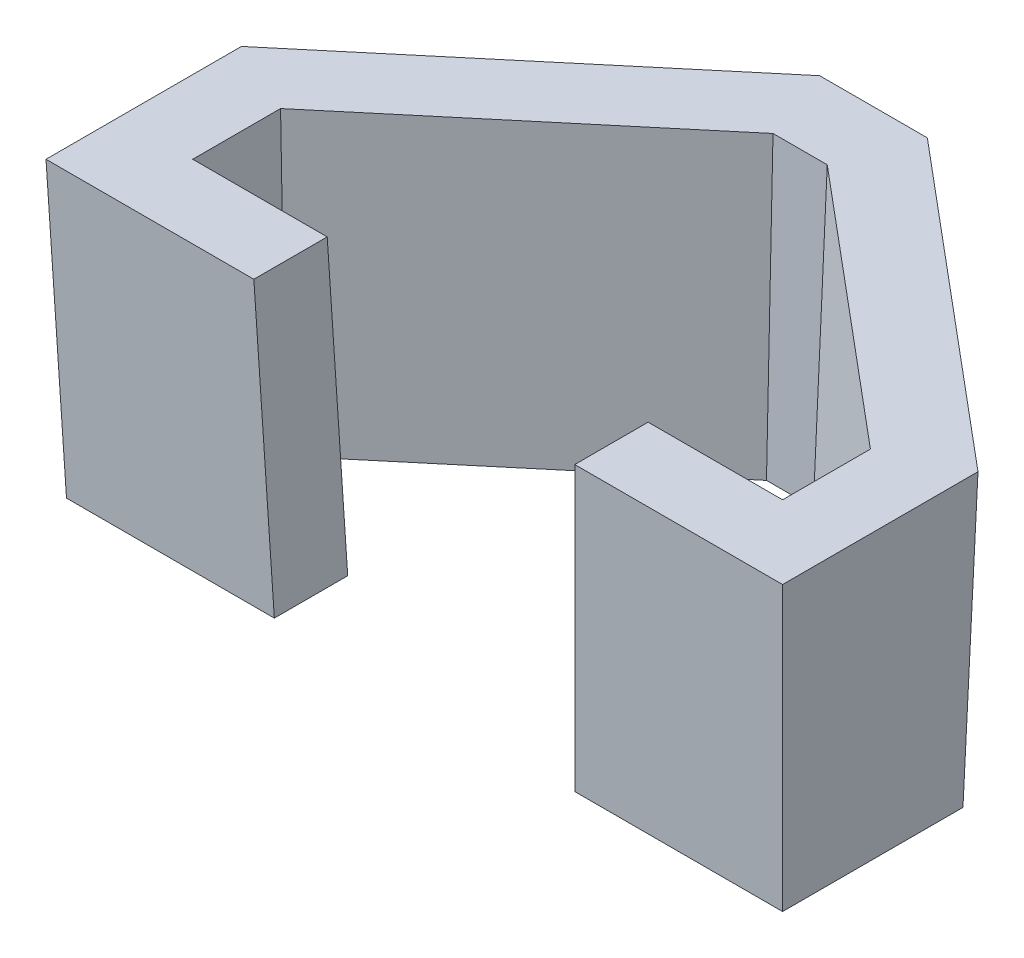
ISO-10303-21;
HEADER;
FILE_DESCRIPTION(('STEP AP214'),'2;1');
FILE_NAME('part.step','',(''),(''),'','','');
FILE_SCHEMA(('AUTOMOTIVE_DESIGN { 1 0 10303 214 1 1 1 1 }'));
ENDSEC;
DATA;
#1=APPLICATION_CONTEXT('core data for automotive mechanical design processes');
#2=APPLICATION_PROTOCOL_DEFINITION('international standard','automotive_design',2000,#1);
#3=PRODUCT_CONTEXT('',#1,'mechanical');
#4=PRODUCT('Part','Part','',(#3));
#5=PRODUCT_RELATED_PRODUCT_CATEGORY('part','',(#4));
#6=PRODUCT_DEFINITION_FORMATION('','',#4);
#7=PRODUCT_DEFINITION_CONTEXT('part definition',#1,'design');
#8=PRODUCT_DEFINITION('design','',#6,#7);
#9=PRODUCT_DEFINITION_SHAPE('','',#8);
#10=(LENGTH_UNIT() NAMED_UNIT(*) SI_UNIT(.MILLI.,.METRE.));
#11=(NAMED_UNIT(*) PLANE_ANGLE_UNIT() SI_UNIT($,.RADIAN.));
#12=(NAMED_UNIT(*) SI_UNIT($,.STERADIAN.) SOLID_ANGLE_UNIT());
#13=UNCERTAINTY_MEASURE_WITH_UNIT(LENGTH_MEASURE(1.E-05),#10,'distance_accuracy_value','');
#14=(GEOMETRIC_REPRESENTATION_CONTEXT(3) GLOBAL_UNCERTAINTY_ASSIGNED_CONTEXT((#13)) GLOBAL_UNIT_ASSIGNED_CONTEXT((#10,
#11,#12)) REPRESENTATION_CONTEXT('',''));
#15=CARTESIAN_POINT('',(0.,0.,0.));
#16=DIRECTION('',(0.,0.,1.));
#17=DIRECTION('',(1.,0.,0.));
#18=AXIS2_PLACEMENT_3D('',#15,#16,#17);
#19=CARTESIAN_POINT('',(111.25,0.,12.7));
#20=DIRECTION('',(0.,-0.034899496702501,0.999390827019096));
#21=DIRECTION('',(0.,-0.999390827019096,-0.034899496702501));
#22=AXIS2_PLACEMENT_3D('',#19,#20,#21);
#23=PLANE('',#22);
#24=DIRECTION('',(1.,0.,0.));
#25=VECTOR('',#24,1.);
#26=CARTESIAN_POINT('',(111.25,50.8,14.4739750901808));
#27=LINE('',#26,#25);
#28=CARTESIAN_POINT('',(77.0489750901808,50.8,14.4739750901808));
#29=VERTEX_POINT('',#28);
#30=CARTESIAN_POINT('',(113.023975090181,50.8,14.4739750901808));
#31=VERTEX_POINT('',#30);
#32=EDGE_CURVE('E327',#29,#31,#27,.T.);
#33=ORIENTED_EDGE('',*,*,#32,.F.);
#34=DIRECTION('',(-0.0348782627423747,-0.998782765958718,-0.0348782627423747));
#35=VECTOR('',#34,1.);
#36=CARTESIAN_POINT('',(75.2595505362086,-0.442414758217532,12.6845505362085));
#37=LINE('',#36,#35);
#38=CARTESIAN_POINT('',(75.275,0.,12.7));
#39=VERTEX_POINT('',#38);
#40=EDGE_CURVE('E317',#29,#39,#37,.T.);
#41=ORIENTED_EDGE('',*,*,#40,.T.);
#42=DIRECTION('',(-1.,0.,0.));
#43=VECTOR('',#42,1.);
#44=CARTESIAN_POINT('',(111.25,0.,12.7));
#45=LINE('',#44,#43);
#46=CARTESIAN_POINT('',(111.25,0.,12.7));
#47=VERTEX_POINT('',#46);
#48=EDGE_CURVE('E196',#47,#39,#45,.T.);
#49=ORIENTED_EDGE('',*,*,#48,.F.);
#50=DIRECTION('',(-0.0348782627423747,-0.998782765958718,-0.0348782627423747));
#51=VECTOR('',#50,1.);
#52=CARTESIAN_POINT('',(111.212017180763,-1.08768563205724,12.6620171807634));
#53=LINE('',#52,#51);
#54=EDGE_CURVE('E222',#31,#47,#53,.T.);
#55=ORIENTED_EDGE('',*,*,#54,.F.);
#56=EDGE_LOOP('',(#33,#41,#49,#55));
#57=FACE_BOUND('',#56,.T.);
#58=ADVANCED_FACE('F46',(#57),#23,.T.);
#59=CARTESIAN_POINT('',(98.55,0.,0.));
#60=DIRECTION('',(0.,-0.034899496702501,0.999390827019096));
#61=DIRECTION('',(0.,-0.999390827019096,-0.0348994967025011));
#62=AXIS2_PLACEMENT_3D('',#59,#60,#61);
#63=PLANE('',#62);
#64=DIRECTION('',(0.0348782627423747,0.998782765958718,0.0348782627423747));
#65=VECTOR('',#64,1.);
#66=CARTESIAN_POINT('',(75.3033138795076,0.810803425001026,0.0283138795075805));
#67=LINE('',#66,#65);
#68=CARTESIAN_POINT('',(75.275,0.,0.));
#69=VERTEX_POINT('',#68);
#70=CARTESIAN_POINT('',(77.0489750901808,50.8,1.77397509018079));
#71=VERTEX_POINT('',#70);
#72=EDGE_CURVE('E11',#69,#71,#67,.T.);
#73=ORIENTED_EDGE('',*,*,#72,.T.);
#74=DIRECTION('',(-1.,0.,0.));
#75=VECTOR('',#74,1.);
#76=CARTESIAN_POINT('',(101.169057711881,50.8,1.77397509018079));
#77=LINE('',#76,#75);
#78=CARTESIAN_POINT('',(100.323975090181,50.8,1.77397509018079));
#79=VERTEX_POINT('',#78);
#80=EDGE_CURVE('E62',#79,#71,#77,.T.);
#81=ORIENTED_EDGE('',*,*,#80,.F.);
#82=DIRECTION('',(-0.0348782627423747,-0.998782765958718,-0.0348782627423747));
#83=VECTOR('',#82,1.);
#84=CARTESIAN_POINT('',(98.5346721855297,-0.438931177444165,-0.0153278144702715));
#85=LINE('',#84,#83);
#86=CARTESIAN_POINT('',(98.55,0.,0.));
#87=VERTEX_POINT('',#86);
#88=EDGE_CURVE('E177',#79,#87,#85,.T.);
#89=ORIENTED_EDGE('',*,*,#88,.T.);
#90=DIRECTION('',(-1.,0.,0.));
#91=VECTOR('',#90,1.);
#92=CARTESIAN_POINT('',(98.55,0.,0.));
#93=LINE('',#92,#91);
#94=EDGE_CURVE('E287',#87,#69,#93,.T.);
#95=ORIENTED_EDGE('',*,*,#94,.T.);
#96=EDGE_LOOP('',(#73,#81,#89,#95));
#97=FACE_BOUND('',#96,.T.);
#98=ADVANCED_FACE('F412',(#97),#63,.F.);
#99=DIRECTION('',(1.,0.,0.));
#100=VECTOR('',#99,1.);
#101=CARTESIAN_POINT('',(111.25,50.8,14.4739750901808));
#102=LINE('',#101,#100);
#103=CARTESIAN_POINT('',(-14.4739750901808,50.8,14.4739750901808));
#104=VERTEX_POINT('',#103);
#105=CARTESIAN_POINT('',(21.5010249098192,50.8,14.4739750901808));
#106=VERTEX_POINT('',#105);
#107=EDGE_CURVE('E330',#104,#106,#102,.T.);
#108=ORIENTED_EDGE('',*,*,#107,.F.);
#109=DIRECTION('',(0.0348782627423747,-0.998782765958718,-0.0348782627423747));
#110=VECTOR('',#109,1.);
#111=CARTESIAN_POINT('',(-12.5492156663818,-4.31789836858764,12.5492156663818));
#112=LINE('',#111,#110);
#113=CARTESIAN_POINT('',(-12.7,0.,12.7));
#114=VERTEX_POINT('',#113);
#115=EDGE_CURVE('E221',#104,#114,#112,.T.);
#116=ORIENTED_EDGE('',*,*,#115,.T.);
#117=CARTESIAN_POINT('',(23.275,0.,12.7));
#118=VERTEX_POINT('',#117);
#119=EDGE_CURVE('E201',#118,#114,#45,.T.);
#120=ORIENTED_EDGE('',*,*,#119,.F.);
#121=DIRECTION('',(0.0348782627423747,-0.998782765958718,-0.0348782627423747));
#122=VECTOR('',#121,1.);
#123=CARTESIAN_POINT('',(23.275,0.,12.7));
#124=LINE('',#123,#122);
#125=EDGE_CURVE('E314',#106,#118,#124,.T.);
#126=ORIENTED_EDGE('',*,*,#125,.F.);
#127=EDGE_LOOP('',(#108,#116,#120,#126));
#128=FACE_BOUND('',#127,.T.);
#129=ADVANCED_FACE('F415',(#128),#23,.T.);
#130=CARTESIAN_POINT('',(111.25,0.,-18.5232068902524));
#131=DIRECTION('',(0.999390827019096,-0.034899496702501,0.));
#132=DIRECTION('',(0.0348994967025011,0.999390827019096,0.));
#133=AXIS2_PLACEMENT_3D('',#130,#131,#132);
#134=PLANE('',#133);
#135=DIRECTION('',(0.,0.,-1.));
#136=VECTOR('',#135,1.);
#137=CARTESIAN_POINT('',(113.023975090181,50.8,-18.5232068902524));
#138=LINE('',#137,#136);
#139=CARTESIAN_POINT('',(113.023975090181,50.8,-19.3505786601181));
#140=VERTEX_POINT('',#139);
#141=EDGE_CURVE('E333',#31,#140,#138,.T.);
#142=ORIENTED_EDGE('',*,*,#141,.F.);
#143=ORIENTED_EDGE('',*,*,#54,.T.);
#144=DIRECTION('',(0.,0.,1.));
#145=VECTOR('',#144,1.);
#146=CARTESIAN_POINT('',(111.25,0.,-18.5232068902524));
#147=LINE('',#146,#145);
#148=CARTESIAN_POINT('',(111.25,0.,-18.5232068902524));
#149=VERTEX_POINT('',#148);
#150=EDGE_CURVE('E217',#149,#47,#147,.T.);
#151=ORIENTED_EDGE('',*,*,#150,.F.);
#152=DIRECTION('',(-0.0348948745148471,-0.999258464882715,0.0162747685953412));
#153=VECTOR('',#152,1.);
#154=CARTESIAN_POINT('',(111.210488163233,-1.13147096533441,-18.5047787970409));
#155=LINE('',#154,#153);
#156=EDGE_CURVE('E225',#140,#149,#155,.T.);
#157=ORIENTED_EDGE('',*,*,#156,.F.);
#158=EDGE_LOOP('',(#142,#143,#151,#157));
#159=FACE_BOUND('',#158,.T.);
#160=ADVANCED_FACE('F425',(#159),#134,.T.);
#161=CARTESIAN_POINT('',(57.9463991500488,0.,-63.2373203455384));
#162=DIRECTION('',(0.642287141369066,-0.034899496702501,-0.765669153852932));
#163=DIRECTION('',(-0.766135863120447,0.,-0.642678643834294));
#164=AXIS2_PLACEMENT_3D('',#161,#162,#163);
#165=PLANE('',#164);
#166=DIRECTION('',(-0.766135863120447,0.,-0.642678643834294));
#167=VECTOR('',#166,1.);
#168=CARTESIAN_POINT('',(59.086495055202,50.8,-64.5964262824082));
#169=LINE('',#168,#167);
#170=CARTESIAN_POINT('',(58.5919304078417,50.8,-65.0112954357192));
#171=VERTEX_POINT('',#170);
#172=EDGE_CURVE('E336',#140,#171,#169,.T.);
#173=ORIENTED_EDGE('',*,*,#172,.F.);
#174=ORIENTED_EDGE('',*,*,#156,.T.);
#175=DIRECTION('',(0.766135863120447,0.,0.642678643834294));
#176=VECTOR('',#175,1.);
#177=CARTESIAN_POINT('',(57.9463991500488,0.,-63.2373203455384));
#178=LINE('',#177,#176);
#179=CARTESIAN_POINT('',(57.9463991500488,0.,-63.2373203455384));
#180=VERTEX_POINT('',#179);
#181=EDGE_CURVE('E213',#180,#149,#178,.T.);
#182=ORIENTED_EDGE('',*,*,#181,.F.);
#183=DIRECTION('',(-0.0126985433124823,-0.999310246384854,0.0348966827647472));
#184=VECTOR('',#183,1.);
#185=CARTESIAN_POINT('',(57.9436025717553,-0.220076372124338,-63.2296351092768));
#186=LINE('',#185,#184);
#187=EDGE_CURVE('E234',#171,#180,#186,.T.);
#188=ORIENTED_EDGE('',*,*,#187,.F.);
#189=EDGE_LOOP('',(#173,#174,#182,#188));
#190=FACE_BOUND('',#189,.T.);
#191=ADVANCED_FACE('F430',(#190),#165,.T.);
#192=CARTESIAN_POINT('',(40.6036008499512,0.,-63.2373203455384));
#193=DIRECTION('',(0.,-0.034899496702501,-0.999390827019096));
#194=DIRECTION('',(0.,0.999390827019096,-0.034899496702501));
#195=AXIS2_PLACEMENT_3D('',#192,#193,#194);
#196=PLANE('',#195);
#197=DIRECTION('',(-1.,0.,0.));
#198=VECTOR('',#197,1.);
#199=CARTESIAN_POINT('',(40.6036008499512,50.8,-65.0112954357192));
#200=LINE('',#199,#198);
#201=CARTESIAN_POINT('',(39.9580695921583,50.8,-65.0112954357192));
#202=VERTEX_POINT('',#201);
#203=EDGE_CURVE('E339',#171,#202,#200,.T.);
#204=ORIENTED_EDGE('',*,*,#203,.F.);
#205=ORIENTED_EDGE('',*,*,#187,.T.);
#206=DIRECTION('',(1.,0.,0.));
#207=VECTOR('',#206,1.);
#208=CARTESIAN_POINT('',(40.6036008499512,0.,-63.2373203455384));
#209=LINE('',#208,#207);
#210=CARTESIAN_POINT('',(40.6036008499512,0.,-63.2373203455384));
#211=VERTEX_POINT('',#210);
#212=EDGE_CURVE('E209',#211,#180,#209,.T.);
#213=ORIENTED_EDGE('',*,*,#212,.F.);
#214=DIRECTION('',(0.0126985433124823,-0.999310246384854,0.0348966827647472));
#215=VECTOR('',#214,1.);
#216=CARTESIAN_POINT('',(40.6148199640562,-0.882886753589432,-63.206489260729));
#217=LINE('',#216,#215);
#218=EDGE_CURVE('E231',#202,#211,#217,.T.);
#219=ORIENTED_EDGE('',*,*,#218,.F.);
#220=EDGE_LOOP('',(#204,#205,#213,#219));
#221=FACE_BOUND('',#220,.T.);
#222=ADVANCED_FACE('F465',(#221),#196,.T.);
#223=CARTESIAN_POINT('',(-12.7,0.,-18.5232068902524));
#224=DIRECTION('',(-0.642287141369066,-0.034899496702501,-0.765669153852932));
#225=DIRECTION('',(-0.766135863120447,0.,0.642678643834294));
#226=AXIS2_PLACEMENT_3D('',#223,#224,#225);
#227=PLANE('',#226);
#228=DIRECTION('',(-0.766135863120447,0.,0.642678643834294));
#229=VECTOR('',#228,1.);
#230=CARTESIAN_POINT('',(-13.8400959051532,50.8,-19.8823128271222));
#231=LINE('',#230,#229);
#232=CARTESIAN_POINT('',(-14.4739750901808,50.8,-19.3505786601181));
#233=VERTEX_POINT('',#232);
#234=EDGE_CURVE('E342',#202,#233,#231,.T.);
#235=ORIENTED_EDGE('',*,*,#234,.F.);
#236=ORIENTED_EDGE('',*,*,#218,.T.);
#237=DIRECTION('',(0.766135863120447,0.,-0.642678643834294));
#238=VECTOR('',#237,1.);
#239=CARTESIAN_POINT('',(-12.7,0.,-18.5232068902524));
#240=LINE('',#239,#238);
#241=CARTESIAN_POINT('',(-12.7,0.,-18.5232068902524));
#242=VERTEX_POINT('',#241);
#243=EDGE_CURVE('E205',#242,#211,#240,.T.);
#244=ORIENTED_EDGE('',*,*,#243,.F.);
#245=DIRECTION('',(0.0348948745148471,-0.999258464882716,0.0162747685953412));
#246=VECTOR('',#245,1.);
#247=CARTESIAN_POINT('',(-12.6822681532213,-0.507773655527217,-18.5149368589912));
#248=LINE('',#247,#246);
#249=EDGE_CURVE('E228',#233,#242,#248,.T.);
#250=ORIENTED_EDGE('',*,*,#249,.F.);
#251=EDGE_LOOP('',(#235,#236,#244,#250));
#252=FACE_BOUND('',#251,.T.);
#253=ADVANCED_FACE('F462',(#252),#227,.T.);
#254=CARTESIAN_POINT('',(-12.7,0.,12.7));
#255=DIRECTION('',(-0.999390827019096,-0.034899496702501,0.));
#256=DIRECTION('',(0.0348994967025011,-0.999390827019096,0.));
#257=AXIS2_PLACEMENT_3D('',#254,#255,#256);
#258=PLANE('',#257);
#259=DIRECTION('',(0.,0.,1.));
#260=VECTOR('',#259,1.);
#261=CARTESIAN_POINT('',(-14.4739750901808,50.8,12.7));
#262=LINE('',#261,#260);
#263=EDGE_CURVE('E169',#233,#104,#262,.T.);
#264=ORIENTED_EDGE('',*,*,#263,.F.);
#265=ORIENTED_EDGE('',*,*,#249,.T.);
#266=DIRECTION('',(0.,0.,-1.));
#267=VECTOR('',#266,1.);
#268=CARTESIAN_POINT('',(-12.7,0.,12.7));
#269=LINE('',#268,#267);
#270=EDGE_CURVE('E200',#114,#242,#269,.T.);
#271=ORIENTED_EDGE('',*,*,#270,.F.);
#272=ORIENTED_EDGE('',*,*,#115,.F.);
#273=EDGE_LOOP('',(#264,#265,#271,#272));
#274=FACE_BOUND('',#273,.T.);
#275=ADVANCED_FACE('F440',(#274),#258,.T.);
#276=CARTESIAN_POINT('',(0.,0.,0.));
#277=DIRECTION('',(0.,1.,0.));
#278=DIRECTION('',(0.,0.,1.));
#279=AXIS2_PLACEMENT_3D('',#276,#277,#278);
#280=PLANE('',#279);
#281=ORIENTED_EDGE('',*,*,#48,.T.);
#282=DIRECTION('',(0.,0.,1.));
#283=VECTOR('',#282,1.);
#284=CARTESIAN_POINT('',(75.275,0.,0.));
#285=LINE('',#284,#283);
#286=EDGE_CURVE('E323',#69,#39,#285,.T.);
#287=ORIENTED_EDGE('',*,*,#286,.F.);
#288=ORIENTED_EDGE('',*,*,#94,.F.);
#289=DIRECTION('',(0.,0.,1.));
#290=VECTOR('',#289,1.);
#291=CARTESIAN_POINT('',(98.55,0.,-12.6));
#292=LINE('',#291,#290);
#293=CARTESIAN_POINT('',(98.55,0.,-12.6));
#294=VERTEX_POINT('',#293);
#295=EDGE_CURVE('E299',#294,#87,#292,.T.);
#296=ORIENTED_EDGE('',*,*,#295,.F.);
#297=DIRECTION('',(0.766135863120447,0.,0.642678643834294));
#298=VECTOR('',#297,1.);
#299=CARTESIAN_POINT('',(53.325,0.,-50.5373203455384));
#300=LINE('',#299,#298);
#301=CARTESIAN_POINT('',(53.325,0.,-50.5373203455384));
#302=VERTEX_POINT('',#301);
#303=EDGE_CURVE('E182',#302,#294,#300,.T.);
#304=ORIENTED_EDGE('',*,*,#303,.F.);
#305=DIRECTION('',(1.,0.,0.));
#306=VECTOR('',#305,1.);
#307=CARTESIAN_POINT('',(45.225,0.,-50.5373203455384));
#308=LINE('',#307,#306);
#309=CARTESIAN_POINT('',(45.225,0.,-50.5373203455384));
#310=VERTEX_POINT('',#309);
#311=EDGE_CURVE('E304',#310,#302,#308,.T.);
#312=ORIENTED_EDGE('',*,*,#311,.F.);
#313=DIRECTION('',(0.766135863120447,0.,-0.642678643834294));
#314=VECTOR('',#313,1.);
#315=CARTESIAN_POINT('',(0.,0.,-12.6));
#316=LINE('',#315,#314);
#317=CARTESIAN_POINT('',(0.,0.,-12.6));
#318=VERTEX_POINT('',#317);
#319=EDGE_CURVE('E307',#318,#310,#316,.T.);
#320=ORIENTED_EDGE('',*,*,#319,.F.);
#321=DIRECTION('',(0.,0.,-1.));
#322=VECTOR('',#321,1.);
#323=CARTESIAN_POINT('',(0.,0.,0.));
#324=LINE('',#323,#322);
#325=CARTESIAN_POINT('',(0.,0.,0.));
#326=VERTEX_POINT('',#325);
#327=EDGE_CURVE('E310',#326,#318,#324,.T.);
#328=ORIENTED_EDGE('',*,*,#327,.F.);
#329=CARTESIAN_POINT('',(23.275,0.,0.));
#330=VERTEX_POINT('',#329);
#331=EDGE_CURVE('E298',#330,#326,#93,.T.);
#332=ORIENTED_EDGE('',*,*,#331,.F.);
#333=DIRECTION('',(0.,0.,-1.));
#334=VECTOR('',#333,1.);
#335=CARTESIAN_POINT('',(23.275,0.,0.));
#336=LINE('',#335,#334);
#337=EDGE_CURVE('E320',#118,#330,#336,.T.);
#338=ORIENTED_EDGE('',*,*,#337,.F.);
#339=ORIENTED_EDGE('',*,*,#119,.T.);
#340=ORIENTED_EDGE('',*,*,#270,.T.);
#341=ORIENTED_EDGE('',*,*,#243,.T.);
#342=ORIENTED_EDGE('',*,*,#212,.T.);
#343=ORIENTED_EDGE('',*,*,#181,.T.);
#344=ORIENTED_EDGE('',*,*,#150,.T.);
#345=EDGE_LOOP('',(#281,#287,#288,#296,#304,#312,#320,#328,#332,#338,#339,#340,#341,#342,#343,#344));
#346=FACE_BOUND('',#345,.T.);
#347=ADVANCED_FACE('F48',(#346),#280,.F.);
#348=CARTESIAN_POINT('',(0.,0.,0.));
#349=DIRECTION('',(-0.999390827019096,-0.034899496702501,0.));
#350=DIRECTION('',(0.034899496702501,-0.999390827019096,0.));
#351=AXIS2_PLACEMENT_3D('',#348,#349,#350);
#352=PLANE('',#351);
#353=DIRECTION('',(0.0348948745148471,-0.999258464882715,0.0162747685953412));
#354=VECTOR('',#353,1.);
#355=CARTESIAN_POINT('',(0.0071556156994482,-0.204910023564566,-12.5966626620303));
#356=LINE('',#355,#354);
#357=CARTESIAN_POINT('',(-1.77397509018079,50.8,-13.4273717698657));
#358=VERTEX_POINT('',#357);
#359=EDGE_CURVE('E284',#358,#318,#356,.T.);
#360=ORIENTED_EDGE('',*,*,#359,.F.);
#361=DIRECTION('',(0.,0.,-1.));
#362=VECTOR('',#361,1.);
#363=CARTESIAN_POINT('',(-1.77397509018079,50.8,2.61905771188109));
#364=LINE('',#363,#362);
#365=CARTESIAN_POINT('',(-1.77397509018079,50.8,1.77397509018079));
#366=VERTEX_POINT('',#365);
#367=EDGE_CURVE('E358',#366,#358,#364,.T.);
#368=ORIENTED_EDGE('',*,*,#367,.F.);
#369=DIRECTION('',(0.0348782627423747,-0.998782765958718,-0.0348782627423747));
#370=VECTOR('',#369,1.);
#371=CARTESIAN_POINT('',(0.119885406035317,-3.43306885215258,-0.119885406035319));
#372=LINE('',#371,#370);
#373=EDGE_CURVE('E190',#366,#326,#372,.T.);
#374=ORIENTED_EDGE('',*,*,#373,.T.);
#375=ORIENTED_EDGE('',*,*,#327,.T.);
#376=EDGE_LOOP('',(#360,#368,#374,#375));
#377=FACE_BOUND('',#376,.T.);
#378=ADVANCED_FACE('F396',(#377),#352,.F.);
#379=ORIENTED_EDGE('',*,*,#373,.F.);
#380=DIRECTION('',(-1.,0.,0.));
#381=VECTOR('',#380,1.);
#382=CARTESIAN_POINT('',(20.6559422881189,50.8,1.77397509018079));
#383=LINE('',#382,#381);
#384=CARTESIAN_POINT('',(21.5010249098192,50.8,1.77397509018079));
#385=VERTEX_POINT('',#384);
#386=EDGE_CURVE('E355',#385,#366,#383,.T.);
#387=ORIENTED_EDGE('',*,*,#386,.F.);
#388=DIRECTION('',(0.0348782627423747,-0.998782765958718,-0.0348782627423747));
#389=VECTOR('',#388,1.);
#390=CARTESIAN_POINT('',(23.3665715265278,-2.62226542715155,-0.0915715265277389));
#391=LINE('',#390,#389);
#392=EDGE_CURVE('E55',#385,#330,#391,.T.);
#393=ORIENTED_EDGE('',*,*,#392,.T.);
#394=ORIENTED_EDGE('',*,*,#331,.T.);
#395=EDGE_LOOP('',(#379,#387,#393,#394));
#396=FACE_BOUND('',#395,.T.);
#397=ADVANCED_FACE('F389',(#396),#63,.F.);
#398=CARTESIAN_POINT('',(98.55,0.,-12.6));
#399=DIRECTION('',(0.999390827019096,-0.034899496702501,0.));
#400=DIRECTION('',(0.034899496702501,0.999390827019096,0.));
#401=AXIS2_PLACEMENT_3D('',#398,#399,#400);
#402=PLANE('',#401);
#403=ORIENTED_EDGE('',*,*,#88,.F.);
#404=DIRECTION('',(0.,0.,1.));
#405=VECTOR('',#404,1.);
#406=CARTESIAN_POINT('',(100.323975090181,50.8,-13.8215134397624));
#407=LINE('',#406,#405);
#408=CARTESIAN_POINT('',(100.323975090181,50.8,-13.4273717698657));
#409=VERTEX_POINT('',#408);
#410=EDGE_CURVE('E162',#409,#79,#407,.T.);
#411=ORIENTED_EDGE('',*,*,#410,.F.);
#412=DIRECTION('',(-0.0348948745148471,-0.999258464882716,0.0162747685953412));
#413=VECTOR('',#412,1.);
#414=CARTESIAN_POINT('',(98.5164765083541,-0.959987197699711,-12.5843648364801));
#415=LINE('',#414,#413);
#416=EDGE_CURVE('E175',#409,#294,#415,.T.);
#417=ORIENTED_EDGE('',*,*,#416,.T.);
#418=ORIENTED_EDGE('',*,*,#295,.T.);
#419=EDGE_LOOP('',(#403,#411,#417,#418));
#420=FACE_BOUND('',#419,.T.);
#421=ADVANCED_FACE('F173',(#420),#402,.F.);
#422=CARTESIAN_POINT('',(53.325,0.,-50.5373203455384));
#423=DIRECTION('',(0.642287141369066,-0.034899496702501,-0.765669153852933));
#424=DIRECTION('',(-0.766135863120447,0.,-0.642678643834294));
#425=AXIS2_PLACEMENT_3D('',#422,#423,#424);
#426=PLANE('',#425);
#427=ORIENTED_EDGE('',*,*,#416,.F.);
#428=DIRECTION('',(0.766135863120447,0.,0.642678643834294));
#429=VECTOR('',#428,1.);
#430=CARTESIAN_POINT('',(53.7349315635779,50.8,-52.508929953635));
#431=LINE('',#430,#429);
#432=CARTESIAN_POINT('',(53.9705312577929,50.8,-52.3112954357192));
#433=VERTEX_POINT('',#432);
#434=EDGE_CURVE('E159',#433,#409,#431,.T.);
#435=ORIENTED_EDGE('',*,*,#434,.F.);
#436=DIRECTION('',(-0.0126985433124823,-0.999310246384854,0.0348966827647472));
#437=VECTOR('',#436,1.);
#438=CARTESIAN_POINT('',(53.3236938506817,-0.102787254015236,-50.5337309355342));
#439=LINE('',#438,#437);
#440=EDGE_CURVE('E185',#433,#302,#439,.T.);
#441=ORIENTED_EDGE('',*,*,#440,.T.);
#442=ORIENTED_EDGE('',*,*,#303,.T.);
#443=EDGE_LOOP('',(#427,#435,#441,#442));
#444=FACE_BOUND('',#443,.T.);
#445=ADVANCED_FACE('F180',(#444),#426,.F.);
#446=CARTESIAN_POINT('',(45.225,0.,-50.5373203455384));
#447=DIRECTION('',(0.,-0.034899496702501,-0.999390827019096));
#448=DIRECTION('',(0.,0.999390827019096,-0.034899496702501));
#449=AXIS2_PLACEMENT_3D('',#446,#447,#448);
#450=PLANE('',#449);
#451=ORIENTED_EDGE('',*,*,#440,.F.);
#452=DIRECTION('',(1.,0.,0.));
#453=VECTOR('',#452,1.);
#454=CARTESIAN_POINT('',(44.2719518831798,50.8,-52.3112954357192));
#455=LINE('',#454,#453);
#456=CARTESIAN_POINT('',(44.5794687422072,50.8,-52.3112954357192));
#457=VERTEX_POINT('',#456);
#458=EDGE_CURVE('E164',#457,#433,#455,.T.);
#459=ORIENTED_EDGE('',*,*,#458,.F.);
#460=DIRECTION('',(0.0126985433124823,-0.999310246384854,0.0348966827647472));
#461=VECTOR('',#460,1.);
#462=CARTESIAN_POINT('',(45.2345187647233,-0.74907797586659,-50.5111619662118));
#463=LINE('',#462,#461);
#464=EDGE_CURVE('E192',#457,#310,#463,.T.);
#465=ORIENTED_EDGE('',*,*,#464,.T.);
#466=ORIENTED_EDGE('',*,*,#311,.T.);
#467=EDGE_LOOP('',(#451,#459,#465,#466));
#468=FACE_BOUND('',#467,.T.);
#469=ADVANCED_FACE('F401',(#468),#450,.F.);
#470=CARTESIAN_POINT('',(0.,0.,-12.6));
#471=DIRECTION('',(-0.642287141369066,-0.034899496702501,-0.765669153852933));
#472=DIRECTION('',(-0.766135863120447,0.,0.642678643834294));
#473=AXIS2_PLACEMENT_3D('',#470,#471,#472);
#474=PLANE('',#473);
#475=ORIENTED_EDGE('',*,*,#464,.F.);
#476=DIRECTION('',(0.766135863120447,0.,-0.642678643834294));
#477=VECTOR('',#476,1.);
#478=CARTESIAN_POINT('',(-2.07594115863881,50.8,-13.174065335978));
#479=LINE('',#478,#477);
#480=EDGE_CURVE('E361',#358,#457,#479,.T.);
#481=ORIENTED_EDGE('',*,*,#480,.F.);
#482=ORIENTED_EDGE('',*,*,#359,.T.);
#483=ORIENTED_EDGE('',*,*,#319,.T.);
#484=EDGE_LOOP('',(#475,#481,#482,#483));
#485=FACE_BOUND('',#484,.T.);
#486=ADVANCED_FACE('F400',(#485),#474,.F.);
#487=CARTESIAN_POINT('',(23.275,0.,0.));
#488=DIRECTION('',(-0.999390827019096,-0.034899496702501,0.));
#489=DIRECTION('',(0.034899496702501,-0.999390827019096,0.));
#490=AXIS2_PLACEMENT_3D('',#487,#488,#489);
#491=PLANE('',#490);
#492=ORIENTED_EDGE('',*,*,#392,.F.);
#493=DIRECTION('',(0.,0.,-1.));
#494=VECTOR('',#493,1.);
#495=CARTESIAN_POINT('',(21.5010249098192,50.8,15.3190577118811));
#496=LINE('',#495,#494);
#497=EDGE_CURVE('E352',#106,#385,#496,.T.);
#498=ORIENTED_EDGE('',*,*,#497,.F.);
#499=ORIENTED_EDGE('',*,*,#125,.T.);
#500=ORIENTED_EDGE('',*,*,#337,.T.);
#501=EDGE_LOOP('',(#492,#498,#499,#500));
#502=FACE_BOUND('',#501,.T.);
#503=ADVANCED_FACE('F408',(#502),#491,.F.);
#504=CARTESIAN_POINT('',(75.275,0.,0.));
#505=DIRECTION('',(0.999390827019096,-0.034899496702501,0.));
#506=DIRECTION('',(0.034899496702501,0.999390827019096,0.));
#507=AXIS2_PLACEMENT_3D('',#504,#505,#506);
#508=PLANE('',#507);
#509=ORIENTED_EDGE('',*,*,#40,.F.);
#510=DIRECTION('',(0.,0.,1.));
#511=VECTOR('',#510,1.);
#512=CARTESIAN_POINT('',(77.0489750901808,50.8,2.61905771188109));
#513=LINE('',#512,#511);
#514=EDGE_CURVE('E349',#71,#29,#513,.T.);
#515=ORIENTED_EDGE('',*,*,#514,.F.);
#516=ORIENTED_EDGE('',*,*,#72,.F.);
#517=ORIENTED_EDGE('',*,*,#286,.T.);
#518=EDGE_LOOP('',(#509,#515,#516,#517));
#519=FACE_BOUND('',#518,.T.);
#520=ADVANCED_FACE('F445',(#519),#508,.F.);
#521=CARTESIAN_POINT('',(0.,50.8,0.));
#522=DIRECTION('',(0.,-1.,0.));
#523=DIRECTION('',(0.,0.,-1.));
#524=AXIS2_PLACEMENT_3D('',#521,#522,#523);
#525=PLANE('',#524);
#526=ORIENTED_EDGE('',*,*,#32,.T.);
#527=ORIENTED_EDGE('',*,*,#141,.T.);
#528=ORIENTED_EDGE('',*,*,#172,.T.);
#529=ORIENTED_EDGE('',*,*,#203,.T.);
#530=ORIENTED_EDGE('',*,*,#234,.T.);
#531=ORIENTED_EDGE('',*,*,#263,.T.);
#532=ORIENTED_EDGE('',*,*,#107,.T.);
#533=ORIENTED_EDGE('',*,*,#497,.T.);
#534=ORIENTED_EDGE('',*,*,#386,.T.);
#535=ORIENTED_EDGE('',*,*,#367,.T.);
#536=ORIENTED_EDGE('',*,*,#480,.T.);
#537=ORIENTED_EDGE('',*,*,#458,.T.);
#538=ORIENTED_EDGE('',*,*,#434,.T.);
#539=ORIENTED_EDGE('',*,*,#410,.T.);
#540=ORIENTED_EDGE('',*,*,#80,.T.);
#541=ORIENTED_EDGE('',*,*,#514,.T.);
#542=EDGE_LOOP('',(#526,#527,#528,#529,#530,#531,#532,#533,#534,#535,#536,#537,#538,#539,#540,#541));
#543=FACE_BOUND('',#542,.T.);
#544=ADVANCED_FACE('F161',(#543),#525,.F.);
#545=CLOSED_SHELL('',(#58,#98,#129,#160,#191,#222,#253,#275,#347,#378,#397,#421,#445,#469,#486,
#503,#520,#544));
#546=MANIFOLD_SOLID_BREP('B2',#545);
#547=ADVANCED_BREP_SHAPE_REPRESENTATION('',(#18,#546),#14);
#548=SHAPE_DEFINITION_REPRESENTATION(#9,#547);
ENDSEC;
END-ISO-10303-21;
